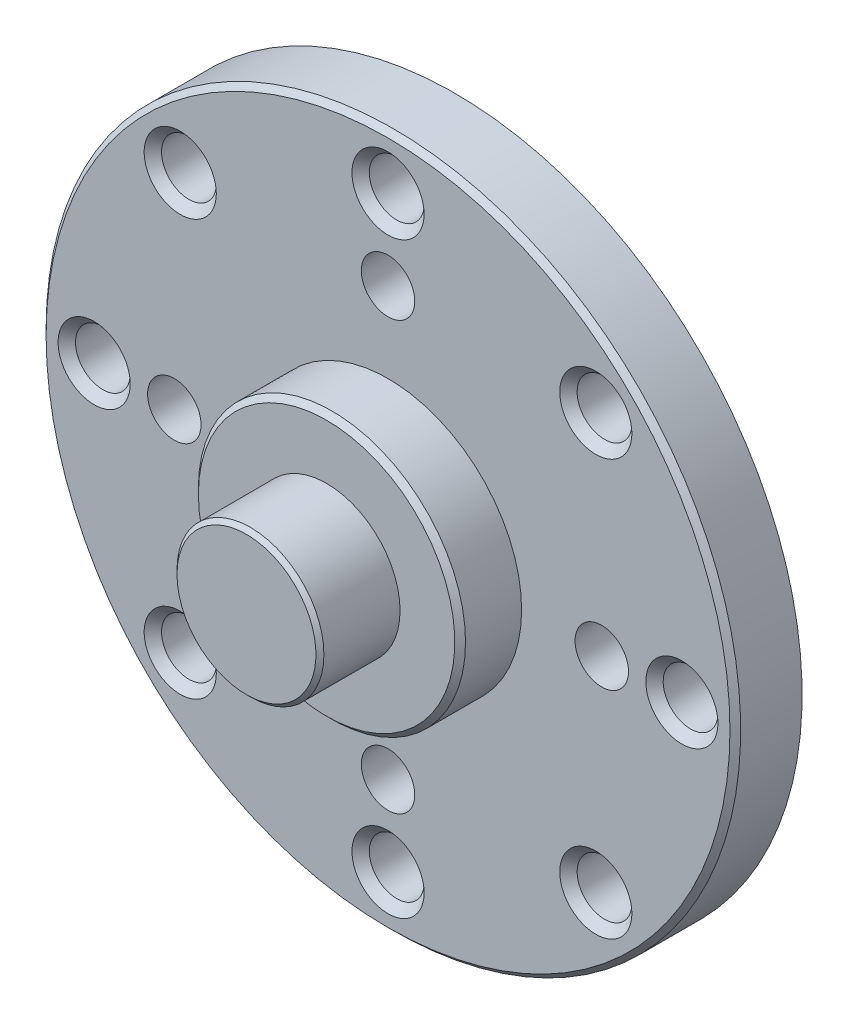
ISO-10303-21;
HEADER;
FILE_DESCRIPTION(('STEP AP214'),'2;1');
FILE_NAME('part.step','',(''),(''),'','','');
FILE_SCHEMA(('AUTOMOTIVE_DESIGN { 1 0 10303 214 1 1 1 1 }'));
ENDSEC;
DATA;
#1=APPLICATION_CONTEXT('core data for automotive mechanical design processes');
#2=APPLICATION_PROTOCOL_DEFINITION('international standard','automotive_design',2000,#1);
#3=PRODUCT_CONTEXT('',#1,'mechanical');
#4=PRODUCT('Part','Part','',(#3));
#5=PRODUCT_RELATED_PRODUCT_CATEGORY('part','',(#4));
#6=PRODUCT_DEFINITION_FORMATION('','',#4);
#7=PRODUCT_DEFINITION_CONTEXT('part definition',#1,'design');
#8=PRODUCT_DEFINITION('design','',#6,#7);
#9=PRODUCT_DEFINITION_SHAPE('','',#8);
#10=(LENGTH_UNIT() NAMED_UNIT(*) SI_UNIT(.MILLI.,.METRE.));
#11=(NAMED_UNIT(*) PLANE_ANGLE_UNIT() SI_UNIT($,.RADIAN.));
#12=(NAMED_UNIT(*) SI_UNIT($,.STERADIAN.) SOLID_ANGLE_UNIT());
#13=UNCERTAINTY_MEASURE_WITH_UNIT(LENGTH_MEASURE(1.E-05),#10,'distance_accuracy_value','');
#14=(GEOMETRIC_REPRESENTATION_CONTEXT(3) GLOBAL_UNCERTAINTY_ASSIGNED_CONTEXT((#13)) GLOBAL_UNIT_ASSIGNED_CONTEXT((#10,
#11,#12)) REPRESENTATION_CONTEXT('',''));
#15=CARTESIAN_POINT('',(0.,0.,0.));
#16=DIRECTION('',(0.,0.,1.));
#17=DIRECTION('',(1.,0.,0.));
#18=AXIS2_PLACEMENT_3D('',#15,#16,#17);
#19=CARTESIAN_POINT('',(14.58431457505,13.35,22.));
#20=DIRECTION('',(0.,0.,1.));
#21=DIRECTION('',(1.,0.,0.));
#22=AXIS2_PLACEMENT_3D('',#19,#20,#21);
#23=PLANE('',#22);
#24=CARTESIAN_POINT('',(0.,11.,22.));
#25=DIRECTION('',(0.,0.,1.));
#26=DIRECTION('',(1.,0.,0.));
#27=AXIS2_PLACEMENT_3D('',#24,#25,#26);
#28=CIRCLE('',#27,1.025);
#29=CARTESIAN_POINT('',(1.025,11.,22.));
#30=VERTEX_POINT('',#29);
#31=EDGE_CURVE('E10',#30,#30,#28,.T.);
#32=ORIENTED_EDGE('',*,*,#31,.T.);
#33=EDGE_LOOP('',(#32));
#34=FACE_BOUND('',#33,.T.);
#35=CARTESIAN_POINT('',(-7.778174593052,7.778174593052,22.));
#36=DIRECTION('',(0.,0.,1.));
#37=DIRECTION('',(1.,0.,0.));
#38=AXIS2_PLACEMENT_3D('',#35,#36,#37);
#39=CIRCLE('',#38,1.025);
#40=CARTESIAN_POINT('',(-6.753174593052,7.778174593052,22.));
#41=VERTEX_POINT('',#40);
#42=EDGE_CURVE('E37',#41,#41,#39,.T.);
#43=ORIENTED_EDGE('',*,*,#42,.T.);
#44=EDGE_LOOP('',(#43));
#45=FACE_BOUND('',#44,.T.);
#46=CARTESIAN_POINT('',(-11.,0.,22.));
#47=DIRECTION('',(0.,0.,1.));
#48=DIRECTION('',(1.,0.,0.));
#49=AXIS2_PLACEMENT_3D('',#46,#47,#48);
#50=CIRCLE('',#49,1.025);
#51=CARTESIAN_POINT('',(-9.975,0.,22.));
#52=VERTEX_POINT('',#51);
#53=EDGE_CURVE('E42',#52,#52,#50,.T.);
#54=ORIENTED_EDGE('',*,*,#53,.T.);
#55=EDGE_LOOP('',(#54));
#56=FACE_BOUND('',#55,.T.);
#57=CARTESIAN_POINT('',(-7.778174593052,-7.778174593052,22.));
#58=DIRECTION('',(0.,0.,1.));
#59=DIRECTION('',(1.,0.,0.));
#60=AXIS2_PLACEMENT_3D('',#57,#58,#59);
#61=CIRCLE('',#60,1.025);
#62=CARTESIAN_POINT('',(-6.753174593052,-7.778174593052,22.));
#63=VERTEX_POINT('',#62);
#64=EDGE_CURVE('E133',#63,#63,#61,.T.);
#65=ORIENTED_EDGE('',*,*,#64,.T.);
#66=EDGE_LOOP('',(#65));
#67=FACE_BOUND('',#66,.T.);
#68=CARTESIAN_POINT('',(0.,-11.,22.));
#69=DIRECTION('',(0.,0.,1.));
#70=DIRECTION('',(1.,0.,0.));
#71=AXIS2_PLACEMENT_3D('',#68,#69,#70);
#72=CIRCLE('',#71,1.025);
#73=CARTESIAN_POINT('',(1.025,-11.,22.));
#74=VERTEX_POINT('',#73);
#75=EDGE_CURVE('E130',#74,#74,#72,.T.);
#76=ORIENTED_EDGE('',*,*,#75,.T.);
#77=EDGE_LOOP('',(#76));
#78=FACE_BOUND('',#77,.T.);
#79=CARTESIAN_POINT('',(7.778174593052,-7.778174593052,22.));
#80=DIRECTION('',(0.,0.,1.));
#81=DIRECTION('',(1.,0.,0.));
#82=AXIS2_PLACEMENT_3D('',#79,#80,#81);
#83=CIRCLE('',#82,1.025);
#84=CARTESIAN_POINT('',(8.803174593052,-7.778174593052,22.));
#85=VERTEX_POINT('',#84);
#86=EDGE_CURVE('E127',#85,#85,#83,.T.);
#87=ORIENTED_EDGE('',*,*,#86,.T.);
#88=EDGE_LOOP('',(#87));
#89=FACE_BOUND('',#88,.T.);
#90=CARTESIAN_POINT('',(11.,0.,22.));
#91=DIRECTION('',(0.,0.,1.));
#92=DIRECTION('',(1.,0.,0.));
#93=AXIS2_PLACEMENT_3D('',#90,#91,#92);
#94=CIRCLE('',#93,1.025);
#95=CARTESIAN_POINT('',(12.025,0.,22.));
#96=VERTEX_POINT('',#95);
#97=EDGE_CURVE('E124',#96,#96,#94,.T.);
#98=ORIENTED_EDGE('',*,*,#97,.T.);
#99=EDGE_LOOP('',(#98));
#100=FACE_BOUND('',#99,.T.);
#101=CARTESIAN_POINT('',(7.778174593052,7.778174593052,22.));
#102=DIRECTION('',(0.,0.,1.));
#103=DIRECTION('',(1.,0.,0.));
#104=AXIS2_PLACEMENT_3D('',#101,#102,#103);
#105=CIRCLE('',#104,1.025);
#106=CARTESIAN_POINT('',(8.803174593052,7.778174593052,22.));
#107=VERTEX_POINT('',#106);
#108=EDGE_CURVE('E120',#107,#107,#105,.T.);
#109=ORIENTED_EDGE('',*,*,#108,.T.);
#110=EDGE_LOOP('',(#109));
#111=FACE_BOUND('',#110,.T.);
#112=CARTESIAN_POINT('',(0.,8.,22.));
#113=DIRECTION('',(0.,0.,1.));
#114=DIRECTION('',(1.,0.,0.));
#115=AXIS2_PLACEMENT_3D('',#112,#113,#114);
#116=CIRCLE('',#115,1.);
#117=CARTESIAN_POINT('',(1.,8.,22.));
#118=VERTEX_POINT('',#117);
#119=EDGE_CURVE('E118',#118,#118,#116,.T.);
#120=ORIENTED_EDGE('',*,*,#119,.T.);
#121=EDGE_LOOP('',(#120));
#122=FACE_BOUND('',#121,.T.);
#123=CARTESIAN_POINT('',(8.,0.,22.));
#124=DIRECTION('',(0.,0.,1.));
#125=DIRECTION('',(1.,0.,0.));
#126=AXIS2_PLACEMENT_3D('',#123,#124,#125);
#127=CIRCLE('',#126,1.);
#128=CARTESIAN_POINT('',(9.,0.,22.));
#129=VERTEX_POINT('',#128);
#130=EDGE_CURVE('E115',#129,#129,#127,.T.);
#131=ORIENTED_EDGE('',*,*,#130,.T.);
#132=EDGE_LOOP('',(#131));
#133=FACE_BOUND('',#132,.T.);
#134=CARTESIAN_POINT('',(-8.,0.,22.));
#135=DIRECTION('',(0.,0.,1.));
#136=DIRECTION('',(1.,0.,0.));
#137=AXIS2_PLACEMENT_3D('',#134,#135,#136);
#138=CIRCLE('',#137,1.);
#139=CARTESIAN_POINT('',(-7.,0.,22.));
#140=VERTEX_POINT('',#139);
#141=EDGE_CURVE('E112',#140,#140,#138,.T.);
#142=ORIENTED_EDGE('',*,*,#141,.T.);
#143=EDGE_LOOP('',(#142));
#144=FACE_BOUND('',#143,.T.);
#145=CARTESIAN_POINT('',(0.,-8.,22.));
#146=DIRECTION('',(0.,0.,1.));
#147=DIRECTION('',(1.,0.,0.));
#148=AXIS2_PLACEMENT_3D('',#145,#146,#147);
#149=CIRCLE('',#148,1.);
#150=CARTESIAN_POINT('',(1.,-8.,22.));
#151=VERTEX_POINT('',#150);
#152=EDGE_CURVE('E65',#151,#151,#149,.T.);
#153=ORIENTED_EDGE('',*,*,#152,.T.);
#154=EDGE_LOOP('',(#153));
#155=FACE_BOUND('',#154,.T.);
#156=CARTESIAN_POINT('',(0.,0.,22.));
#157=DIRECTION('',(0.,0.,-1.));
#158=DIRECTION('',(-1.,0.,0.));
#159=AXIS2_PLACEMENT_3D('',#156,#157,#158);
#160=CIRCLE('',#159,13.);
#161=CARTESIAN_POINT('',(-13.,0.,22.));
#162=VERTEX_POINT('',#161);
#163=EDGE_CURVE('E62',#162,#162,#160,.T.);
#164=ORIENTED_EDGE('',*,*,#163,.T.);
#165=EDGE_LOOP('',(#164));
#166=FACE_BOUND('',#165,.T.);
#167=ADVANCED_FACE('F30',(#34,#45,#56,#67,#78,#89,#100,#111,#122,#133,#144,#155,#166),#23,.F.);
#168=CARTESIAN_POINT('',(0.,0.,29.8));
#169=DIRECTION('',(0.,0.,1.));
#170=DIRECTION('',(1.,0.,0.));
#171=AXIS2_PLACEMENT_3D('',#168,#169,#170);
#172=PLANE('',#171);
#173=CARTESIAN_POINT('',(0.,0.,29.7999999999661));
#174=DIRECTION('',(0.,0.,-1.));
#175=DIRECTION('',(-1.,0.,0.));
#176=AXIS2_PLACEMENT_3D('',#173,#174,#175);
#177=CIRCLE('',#176,2.59999999997262);
#178=CARTESIAN_POINT('',(-2.59999999997262,0.,29.7999999999661));
#179=VERTEX_POINT('',#178);
#180=EDGE_CURVE('E33',#179,#179,#177,.T.);
#181=ORIENTED_EDGE('',*,*,#180,.F.);
#182=EDGE_LOOP('',(#181));
#183=FACE_BOUND('',#182,.T.);
#184=ADVANCED_FACE('F160',(#183),#172,.T.);
#185=CARTESIAN_POINT('',(0.,0.,29.6499999999469));
#186=DIRECTION('',(0.,0.,-1.));
#187=DIRECTION('',(-1.,0.,0.));
#188=AXIS2_PLACEMENT_3D('',#185,#186,#187);
#189=CONICAL_SURFACE('',#188,2.74999999999181,0.785398163397448);
#190=CARTESIAN_POINT('',(0.,0.,29.65));
#191=DIRECTION('',(0.,0.,1.));
#192=DIRECTION('',(1.,0.,0.));
#193=AXIS2_PLACEMENT_3D('',#190,#191,#192);
#194=CIRCLE('',#193,2.75);
#195=CARTESIAN_POINT('',(2.75,0.,29.65));
#196=VERTEX_POINT('',#195);
#197=EDGE_CURVE('E48',#196,#196,#194,.F.);
#198=ORIENTED_EDGE('',*,*,#197,.F.);
#199=EDGE_LOOP('',(#198));
#200=FACE_BOUND('',#199,.T.);
#201=ORIENTED_EDGE('',*,*,#180,.T.);
#202=EDGE_LOOP('',(#201));
#203=FACE_BOUND('',#202,.T.);
#204=ADVANCED_FACE('F165',(#200,#203),#189,.T.);
#205=CARTESIAN_POINT('',(0.,0.,26.8));
#206=DIRECTION('',(0.,0.,1.));
#207=DIRECTION('',(1.,0.,0.));
#208=AXIS2_PLACEMENT_3D('',#205,#206,#207);
#209=CYLINDRICAL_SURFACE('',#208,2.75);
#210=CARTESIAN_POINT('',(0.,0.,26.8));
#211=DIRECTION('',(0.,0.,1.));
#212=DIRECTION('',(1.,0.,0.));
#213=AXIS2_PLACEMENT_3D('',#210,#211,#212);
#214=CIRCLE('',#213,2.75);
#215=CARTESIAN_POINT('',(2.75,0.,26.8));
#216=VERTEX_POINT('',#215);
#217=EDGE_CURVE('E45',#216,#216,#214,.T.);
#218=ORIENTED_EDGE('',*,*,#217,.T.);
#219=EDGE_LOOP('',(#218));
#220=FACE_BOUND('',#219,.T.);
#221=ORIENTED_EDGE('',*,*,#197,.T.);
#222=EDGE_LOOP('',(#221));
#223=FACE_BOUND('',#222,.T.);
#224=ADVANCED_FACE('F347',(#220,#223),#209,.T.);
#225=CARTESIAN_POINT('',(0.,0.,26.8));
#226=DIRECTION('',(0.,0.,-1.));
#227=DIRECTION('',(-1.,0.,0.));
#228=AXIS2_PLACEMENT_3D('',#225,#226,#227);
#229=PLANE('',#228);
#230=ORIENTED_EDGE('',*,*,#217,.F.);
#231=EDGE_LOOP('',(#230));
#232=FACE_BOUND('',#231,.T.);
#233=CARTESIAN_POINT('',(0.,0.,26.7999999999802));
#234=DIRECTION('',(0.,0.,-1.));
#235=DIRECTION('',(-1.,0.,0.));
#236=AXIS2_PLACEMENT_3D('',#233,#234,#235);
#237=CIRCLE('',#236,4.80000000004566);
#238=CARTESIAN_POINT('',(-4.80000000004566,0.,26.7999999999802));
#239=VERTEX_POINT('',#238);
#240=EDGE_CURVE('E47',#239,#239,#237,.T.);
#241=ORIENTED_EDGE('',*,*,#240,.F.);
#242=EDGE_LOOP('',(#241));
#243=FACE_BOUND('',#242,.T.);
#244=ADVANCED_FACE('F236',(#232,#243),#229,.F.);
#245=CARTESIAN_POINT('',(0.,0.,26.6000000000304));
#246=DIRECTION('',(0.,0.,-1.));
#247=DIRECTION('',(-1.,0.,0.));
#248=AXIS2_PLACEMENT_3D('',#245,#246,#247);
#249=CONICAL_SURFACE('',#248,4.99999999999545,0.785398163397448);
#250=CARTESIAN_POINT('',(0.,0.,26.6));
#251=DIRECTION('',(0.,0.,-1.));
#252=DIRECTION('',(-1.,0.,0.));
#253=AXIS2_PLACEMENT_3D('',#250,#251,#252);
#254=CIRCLE('',#253,5.);
#255=CARTESIAN_POINT('',(-5.,0.,26.6));
#256=VERTEX_POINT('',#255);
#257=EDGE_CURVE('E109',#256,#256,#254,.T.);
#258=ORIENTED_EDGE('',*,*,#257,.F.);
#259=EDGE_LOOP('',(#258));
#260=FACE_BOUND('',#259,.T.);
#261=ORIENTED_EDGE('',*,*,#240,.T.);
#262=EDGE_LOOP('',(#261));
#263=FACE_BOUND('',#262,.T.);
#264=ADVANCED_FACE('F232',(#260,#263),#249,.T.);
#265=CARTESIAN_POINT('',(0.,11.,24.4999999999891));
#266=DIRECTION('',(0.,0.,1.));
#267=DIRECTION('',(1.,0.,0.));
#268=AXIS2_PLACEMENT_3D('',#265,#266,#267);
#269=CONICAL_SURFACE('',#268,1.35000000000218,0.785398163397448);
#270=CARTESIAN_POINT('',(0.,11.,24.1750000000138));
#271=DIRECTION('',(0.,0.,1.));
#272=DIRECTION('',(-1.,0.,0.));
#273=AXIS2_PLACEMENT_3D('',#270,#271,#272);
#274=CIRCLE('',#273,1.02500000002692);
#275=CARTESIAN_POINT('',(-1.02500000002692,11.,24.1750000000138));
#276=VERTEX_POINT('',#275);
#277=EDGE_CURVE('E52',#276,#276,#274,.T.);
#278=ORIENTED_EDGE('',*,*,#277,.F.);
#279=EDGE_LOOP('',(#278));
#280=FACE_BOUND('',#279,.T.);
#281=CARTESIAN_POINT('',(0.,11.,24.4999999999891));
#282=DIRECTION('',(0.,0.,1.));
#283=DIRECTION('',(1.,0.,0.));
#284=AXIS2_PLACEMENT_3D('',#281,#282,#283);
#285=CIRCLE('',#284,1.35000000000218);
#286=CARTESIAN_POINT('',(1.35000000000218,11.,24.4999999999891));
#287=VERTEX_POINT('',#286);
#288=EDGE_CURVE('E106',#287,#287,#285,.T.);
#289=ORIENTED_EDGE('',*,*,#288,.T.);
#290=EDGE_LOOP('',(#289));
#291=FACE_BOUND('',#290,.T.);
#292=ADVANCED_FACE('F229',(#280,#291),#269,.F.);
#293=CARTESIAN_POINT('',(0.,11.,21.22832375877));
#294=DIRECTION('',(0.,0.,1.));
#295=DIRECTION('',(1.,0.,0.));
#296=AXIS2_PLACEMENT_3D('',#293,#294,#295);
#297=CYLINDRICAL_SURFACE('',#296,1.025);
#298=ORIENTED_EDGE('',*,*,#277,.T.);
#299=EDGE_LOOP('',(#298));
#300=FACE_BOUND('',#299,.T.);
#301=ORIENTED_EDGE('',*,*,#31,.F.);
#302=EDGE_LOOP('',(#301));
#303=FACE_BOUND('',#302,.T.);
#304=ADVANCED_FACE('F227',(#300,#303),#297,.F.);
#305=CARTESIAN_POINT('',(-7.778174593052,7.778174593052,24.4999999999891));
#306=DIRECTION('',(0.,0.,1.));
#307=DIRECTION('',(1.,0.,0.));
#308=AXIS2_PLACEMENT_3D('',#305,#306,#307);
#309=CONICAL_SURFACE('',#308,1.34999999994634,0.785398163416473);
#310=CARTESIAN_POINT('',(-7.778174593052,7.778174593052,24.1750000000138));
#311=DIRECTION('',(0.,0.,1.));
#312=DIRECTION('',(-0.707106781190956,-0.707106781182139,0.));
#313=AXIS2_PLACEMENT_3D('',#310,#311,#312);
#314=CIRCLE('',#313,1.02499999999201);
#315=CARTESIAN_POINT('',(-8.50295904376708,7.05339014234596,24.1750000000138));
#316=VERTEX_POINT('',#315);
#317=EDGE_CURVE('E332',#316,#316,#314,.T.);
#318=ORIENTED_EDGE('',*,*,#317,.F.);
#319=EDGE_LOOP('',(#318));
#320=FACE_BOUND('',#319,.T.);
#321=CARTESIAN_POINT('',(-7.778174593052,7.778174593052,24.4999999999891));
#322=DIRECTION('',(0.,0.,1.));
#323=DIRECTION('',(1.,0.,0.));
#324=AXIS2_PLACEMENT_3D('',#321,#322,#323);
#325=CIRCLE('',#324,1.34999999994634);
#326=CARTESIAN_POINT('',(-6.42817459310567,7.778174593052,24.4999999999891));
#327=VERTEX_POINT('',#326);
#328=EDGE_CURVE('E103',#327,#327,#325,.T.);
#329=ORIENTED_EDGE('',*,*,#328,.T.);
#330=EDGE_LOOP('',(#329));
#331=FACE_BOUND('',#330,.T.);
#332=ADVANCED_FACE('F224',(#320,#331),#309,.F.);
#333=CARTESIAN_POINT('',(-7.778174593052,7.778174593052,21.22832375877));
#334=DIRECTION('',(0.,0.,1.));
#335=DIRECTION('',(1.,0.,0.));
#336=AXIS2_PLACEMENT_3D('',#333,#334,#335);
#337=CYLINDRICAL_SURFACE('',#336,1.025);
#338=ORIENTED_EDGE('',*,*,#317,.T.);
#339=EDGE_LOOP('',(#338));
#340=FACE_BOUND('',#339,.T.);
#341=ORIENTED_EDGE('',*,*,#42,.F.);
#342=EDGE_LOOP('',(#341));
#343=FACE_BOUND('',#342,.T.);
#344=ADVANCED_FACE('F153',(#340,#343),#337,.F.);
#345=CARTESIAN_POINT('',(-11.,0.,24.4999999999891));
#346=DIRECTION('',(0.,0.,1.));
#347=DIRECTION('',(1.,0.,0.));
#348=AXIS2_PLACEMENT_3D('',#345,#346,#347);
#349=CONICAL_SURFACE('',#348,1.35000000000218,0.785398163397448);
#350=CARTESIAN_POINT('',(-11.,0.,24.1750000000138));
#351=DIRECTION('',(0.,0.,1.));
#352=DIRECTION('',(0.,-1.,0.));
#353=AXIS2_PLACEMENT_3D('',#350,#351,#352);
#354=CIRCLE('',#353,1.02500000002692);
#355=CARTESIAN_POINT('',(-11.,-1.02500000002692,24.1750000000138));
#356=VERTEX_POINT('',#355);
#357=EDGE_CURVE('E331',#356,#356,#354,.T.);
#358=ORIENTED_EDGE('',*,*,#357,.F.);
#359=EDGE_LOOP('',(#358));
#360=FACE_BOUND('',#359,.T.);
#361=CARTESIAN_POINT('',(-11.,0.,24.4999999999891));
#362=DIRECTION('',(0.,0.,1.));
#363=DIRECTION('',(1.,0.,0.));
#364=AXIS2_PLACEMENT_3D('',#361,#362,#363);
#365=CIRCLE('',#364,1.35000000000218);
#366=CARTESIAN_POINT('',(-9.64999999999782,0.,24.4999999999891));
#367=VERTEX_POINT('',#366);
#368=EDGE_CURVE('E100',#367,#367,#365,.T.);
#369=ORIENTED_EDGE('',*,*,#368,.T.);
#370=EDGE_LOOP('',(#369));
#371=FACE_BOUND('',#370,.T.);
#372=ADVANCED_FACE('F143',(#360,#371),#349,.F.);
#373=CARTESIAN_POINT('',(-11.,0.,21.22832375877));
#374=DIRECTION('',(0.,0.,1.));
#375=DIRECTION('',(1.,0.,0.));
#376=AXIS2_PLACEMENT_3D('',#373,#374,#375);
#377=CYLINDRICAL_SURFACE('',#376,1.025);
#378=ORIENTED_EDGE('',*,*,#357,.T.);
#379=EDGE_LOOP('',(#378));
#380=FACE_BOUND('',#379,.T.);
#381=ORIENTED_EDGE('',*,*,#53,.F.);
#382=EDGE_LOOP('',(#381));
#383=FACE_BOUND('',#382,.T.);
#384=ADVANCED_FACE('F140',(#380,#383),#377,.F.);
#385=CARTESIAN_POINT('',(-7.778174593052,-7.778174593052,24.4999999999891));
#386=DIRECTION('',(0.,0.,1.));
#387=DIRECTION('',(1.,0.,0.));
#388=AXIS2_PLACEMENT_3D('',#385,#386,#387);
#389=CONICAL_SURFACE('',#388,1.34999999994634,0.785398163416473);
#390=CARTESIAN_POINT('',(-7.778174593052,-7.778174593052,24.1750000000138));
#391=DIRECTION('',(0.,0.,1.));
#392=DIRECTION('',(0.707106781182139,-0.707106781190956,0.));
#393=AXIS2_PLACEMENT_3D('',#390,#391,#392);
#394=CIRCLE('',#393,1.02499999999201);
#395=CARTESIAN_POINT('',(-7.05339014234596,-8.50295904376708,24.1750000000138));
#396=VERTEX_POINT('',#395);
#397=EDGE_CURVE('E256',#396,#396,#394,.T.);
#398=ORIENTED_EDGE('',*,*,#397,.F.);
#399=EDGE_LOOP('',(#398));
#400=FACE_BOUND('',#399,.T.);
#401=CARTESIAN_POINT('',(-7.778174593052,-7.778174593052,24.4999999999891));
#402=DIRECTION('',(0.,0.,1.));
#403=DIRECTION('',(1.,0.,0.));
#404=AXIS2_PLACEMENT_3D('',#401,#402,#403);
#405=CIRCLE('',#404,1.34999999994634);
#406=CARTESIAN_POINT('',(-6.42817459310567,-7.778174593052,24.4999999999891));
#407=VERTEX_POINT('',#406);
#408=EDGE_CURVE('E97',#407,#407,#405,.T.);
#409=ORIENTED_EDGE('',*,*,#408,.T.);
#410=EDGE_LOOP('',(#409));
#411=FACE_BOUND('',#410,.T.);
#412=ADVANCED_FACE('F142',(#400,#411),#389,.F.);
#413=CARTESIAN_POINT('',(-7.778174593052,-7.778174593052,21.22832375877));
#414=DIRECTION('',(0.,0.,1.));
#415=DIRECTION('',(1.,0.,0.));
#416=AXIS2_PLACEMENT_3D('',#413,#414,#415);
#417=CYLINDRICAL_SURFACE('',#416,1.025);
#418=ORIENTED_EDGE('',*,*,#397,.T.);
#419=EDGE_LOOP('',(#418));
#420=FACE_BOUND('',#419,.T.);
#421=ORIENTED_EDGE('',*,*,#64,.F.);
#422=EDGE_LOOP('',(#421));
#423=FACE_BOUND('',#422,.T.);
#424=ADVANCED_FACE('F150',(#420,#423),#417,.F.);
#425=CARTESIAN_POINT('',(0.,-11.,24.4999999999891));
#426=DIRECTION('',(0.,0.,1.));
#427=DIRECTION('',(1.,0.,0.));
#428=AXIS2_PLACEMENT_3D('',#425,#426,#427);
#429=CONICAL_SURFACE('',#428,1.35000000000218,0.785398163397448);
#430=CARTESIAN_POINT('',(0.,-11.,24.1750000000138));
#431=DIRECTION('',(0.,0.,1.));
#432=DIRECTION('',(1.,0.,0.));
#433=AXIS2_PLACEMENT_3D('',#430,#431,#432);
#434=CIRCLE('',#433,1.02500000002692);
#435=CARTESIAN_POINT('',(1.02500000002692,-11.,24.1750000000138));
#436=VERTEX_POINT('',#435);
#437=EDGE_CURVE('E327',#436,#436,#434,.T.);
#438=ORIENTED_EDGE('',*,*,#437,.F.);
#439=EDGE_LOOP('',(#438));
#440=FACE_BOUND('',#439,.T.);
#441=CARTESIAN_POINT('',(0.,-11.,24.4999999999891));
#442=DIRECTION('',(0.,0.,1.));
#443=DIRECTION('',(1.,0.,0.));
#444=AXIS2_PLACEMENT_3D('',#441,#442,#443);
#445=CIRCLE('',#444,1.35000000000218);
#446=CARTESIAN_POINT('',(1.35000000000218,-11.,24.4999999999891));
#447=VERTEX_POINT('',#446);
#448=EDGE_CURVE('E94',#447,#447,#445,.T.);
#449=ORIENTED_EDGE('',*,*,#448,.T.);
#450=EDGE_LOOP('',(#449));
#451=FACE_BOUND('',#450,.T.);
#452=ADVANCED_FACE('F220',(#440,#451),#429,.F.);
#453=CARTESIAN_POINT('',(0.,-11.,21.22832375877));
#454=DIRECTION('',(0.,0.,1.));
#455=DIRECTION('',(1.,0.,0.));
#456=AXIS2_PLACEMENT_3D('',#453,#454,#455);
#457=CYLINDRICAL_SURFACE('',#456,1.025);
#458=ORIENTED_EDGE('',*,*,#437,.T.);
#459=EDGE_LOOP('',(#458));
#460=FACE_BOUND('',#459,.T.);
#461=ORIENTED_EDGE('',*,*,#75,.F.);
#462=EDGE_LOOP('',(#461));
#463=FACE_BOUND('',#462,.T.);
#464=ADVANCED_FACE('F218',(#460,#463),#457,.F.);
#465=CARTESIAN_POINT('',(7.778174593052,-7.778174593052,24.4999999999891));
#466=DIRECTION('',(0.,0.,1.));
#467=DIRECTION('',(1.,0.,0.));
#468=AXIS2_PLACEMENT_3D('',#465,#466,#467);
#469=CONICAL_SURFACE('',#468,1.34999999994634,0.785398163416473);
#470=CARTESIAN_POINT('',(7.778174593052,-7.778174593052,24.1750000000138));
#471=DIRECTION('',(0.,0.,1.));
#472=DIRECTION('',(0.707106781190956,0.707106781182139,0.));
#473=AXIS2_PLACEMENT_3D('',#470,#471,#472);
#474=CIRCLE('',#473,1.02499999999201);
#475=CARTESIAN_POINT('',(8.50295904376708,-7.05339014234596,24.1750000000138));
#476=VERTEX_POINT('',#475);
#477=EDGE_CURVE('E324',#476,#476,#474,.T.);
#478=ORIENTED_EDGE('',*,*,#477,.F.);
#479=EDGE_LOOP('',(#478));
#480=FACE_BOUND('',#479,.T.);
#481=CARTESIAN_POINT('',(7.778174593052,-7.778174593052,24.4999999999891));
#482=DIRECTION('',(0.,0.,1.));
#483=DIRECTION('',(1.,0.,0.));
#484=AXIS2_PLACEMENT_3D('',#481,#482,#483);
#485=CIRCLE('',#484,1.34999999994634);
#486=CARTESIAN_POINT('',(9.12817459299834,-7.778174593052,24.4999999999891));
#487=VERTEX_POINT('',#486);
#488=EDGE_CURVE('E91',#487,#487,#485,.T.);
#489=ORIENTED_EDGE('',*,*,#488,.T.);
#490=EDGE_LOOP('',(#489));
#491=FACE_BOUND('',#490,.T.);
#492=ADVANCED_FACE('F215',(#480,#491),#469,.F.);
#493=CARTESIAN_POINT('',(7.778174593052,-7.778174593052,21.22832375877));
#494=DIRECTION('',(0.,0.,1.));
#495=DIRECTION('',(1.,0.,0.));
#496=AXIS2_PLACEMENT_3D('',#493,#494,#495);
#497=CYLINDRICAL_SURFACE('',#496,1.025);
#498=ORIENTED_EDGE('',*,*,#477,.T.);
#499=EDGE_LOOP('',(#498));
#500=FACE_BOUND('',#499,.T.);
#501=ORIENTED_EDGE('',*,*,#86,.F.);
#502=EDGE_LOOP('',(#501));
#503=FACE_BOUND('',#502,.T.);
#504=ADVANCED_FACE('F213',(#500,#503),#497,.F.);
#505=CARTESIAN_POINT('',(11.,0.,24.4999999999891));
#506=DIRECTION('',(0.,0.,1.));
#507=DIRECTION('',(1.,0.,0.));
#508=AXIS2_PLACEMENT_3D('',#505,#506,#507);
#509=CONICAL_SURFACE('',#508,1.35000000000218,0.785398163397448);
#510=CARTESIAN_POINT('',(11.,0.,24.1750000000138));
#511=DIRECTION('',(0.,0.,1.));
#512=DIRECTION('',(0.,1.,0.));
#513=AXIS2_PLACEMENT_3D('',#510,#511,#512);
#514=CIRCLE('',#513,1.02500000002692);
#515=CARTESIAN_POINT('',(11.,1.02500000002692,24.1750000000138));
#516=VERTEX_POINT('',#515);
#517=EDGE_CURVE('E318',#516,#516,#514,.T.);
#518=ORIENTED_EDGE('',*,*,#517,.F.);
#519=EDGE_LOOP('',(#518));
#520=FACE_BOUND('',#519,.T.);
#521=CARTESIAN_POINT('',(11.,0.,24.4999999999891));
#522=DIRECTION('',(0.,0.,1.));
#523=DIRECTION('',(1.,0.,0.));
#524=AXIS2_PLACEMENT_3D('',#521,#522,#523);
#525=CIRCLE('',#524,1.35000000000218);
#526=CARTESIAN_POINT('',(12.3500000000022,0.,24.4999999999891));
#527=VERTEX_POINT('',#526);
#528=EDGE_CURVE('E88',#527,#527,#525,.T.);
#529=ORIENTED_EDGE('',*,*,#528,.T.);
#530=EDGE_LOOP('',(#529));
#531=FACE_BOUND('',#530,.T.);
#532=ADVANCED_FACE('F210',(#520,#531),#509,.F.);
#533=CARTESIAN_POINT('',(11.,0.,21.22832375877));
#534=DIRECTION('',(0.,0.,1.));
#535=DIRECTION('',(1.,0.,0.));
#536=AXIS2_PLACEMENT_3D('',#533,#534,#535);
#537=CYLINDRICAL_SURFACE('',#536,1.025);
#538=ORIENTED_EDGE('',*,*,#517,.T.);
#539=EDGE_LOOP('',(#538));
#540=FACE_BOUND('',#539,.T.);
#541=ORIENTED_EDGE('',*,*,#97,.F.);
#542=EDGE_LOOP('',(#541));
#543=FACE_BOUND('',#542,.T.);
#544=ADVANCED_FACE('F208',(#540,#543),#537,.F.);
#545=CARTESIAN_POINT('',(7.778174593052,7.778174593052,24.4999999999891));
#546=DIRECTION('',(0.,0.,1.));
#547=DIRECTION('',(1.,0.,0.));
#548=AXIS2_PLACEMENT_3D('',#545,#546,#547);
#549=CONICAL_SURFACE('',#548,1.34999999994634,0.785398163416473);
#550=CARTESIAN_POINT('',(7.778174593052,7.778174593052,24.1750000000138));
#551=DIRECTION('',(0.,0.,1.));
#552=DIRECTION('',(-0.707106781182139,0.707106781190956,0.));
#553=AXIS2_PLACEMENT_3D('',#550,#551,#552);
#554=CIRCLE('',#553,1.02499999999201);
#555=CARTESIAN_POINT('',(7.05339014234596,8.50295904376708,24.1750000000138));
#556=VERTEX_POINT('',#555);
#557=EDGE_CURVE('E315',#556,#556,#554,.T.);
#558=ORIENTED_EDGE('',*,*,#557,.F.);
#559=EDGE_LOOP('',(#558));
#560=FACE_BOUND('',#559,.T.);
#561=CARTESIAN_POINT('',(7.778174593052,7.778174593052,24.4999999999891));
#562=DIRECTION('',(0.,0.,1.));
#563=DIRECTION('',(1.,0.,0.));
#564=AXIS2_PLACEMENT_3D('',#561,#562,#563);
#565=CIRCLE('',#564,1.34999999994634);
#566=CARTESIAN_POINT('',(9.12817459299834,7.778174593052,24.4999999999891));
#567=VERTEX_POINT('',#566);
#568=EDGE_CURVE('E85',#567,#567,#565,.T.);
#569=ORIENTED_EDGE('',*,*,#568,.T.);
#570=EDGE_LOOP('',(#569));
#571=FACE_BOUND('',#570,.T.);
#572=ADVANCED_FACE('F205',(#560,#571),#549,.F.);
#573=CARTESIAN_POINT('',(7.778174593052,7.778174593052,21.22832375877));
#574=DIRECTION('',(0.,0.,1.));
#575=DIRECTION('',(1.,0.,0.));
#576=AXIS2_PLACEMENT_3D('',#573,#574,#575);
#577=CYLINDRICAL_SURFACE('',#576,1.025);
#578=ORIENTED_EDGE('',*,*,#557,.T.);
#579=EDGE_LOOP('',(#578));
#580=FACE_BOUND('',#579,.T.);
#581=ORIENTED_EDGE('',*,*,#108,.F.);
#582=EDGE_LOOP('',(#581));
#583=FACE_BOUND('',#582,.T.);
#584=ADVANCED_FACE('F203',(#580,#583),#577,.F.);
#585=CARTESIAN_POINT('',(0.,0.,27.25));
#586=DIRECTION('',(0.,0.,-1.));
#587=DIRECTION('',(-1.,0.,0.));
#588=AXIS2_PLACEMENT_3D('',#585,#586,#587);
#589=CYLINDRICAL_SURFACE('',#588,5.);
#590=CARTESIAN_POINT('',(0.,0.,24.5));
#591=DIRECTION('',(0.,0.,-1.));
#592=DIRECTION('',(-1.,0.,0.));
#593=AXIS2_PLACEMENT_3D('',#590,#591,#592);
#594=CIRCLE('',#593,5.);
#595=CARTESIAN_POINT('',(-5.,0.,24.5));
#596=VERTEX_POINT('',#595);
#597=EDGE_CURVE('E82',#596,#596,#594,.F.);
#598=ORIENTED_EDGE('',*,*,#597,.T.);
#599=EDGE_LOOP('',(#598));
#600=FACE_BOUND('',#599,.T.);
#601=ORIENTED_EDGE('',*,*,#257,.T.);
#602=EDGE_LOOP('',(#601));
#603=FACE_BOUND('',#602,.T.);
#604=ADVANCED_FACE('F185',(#600,#603),#589,.T.);
#605=CARTESIAN_POINT('',(0.,0.,24.5));
#606=DIRECTION('',(0.,0.,-1.));
#607=DIRECTION('',(-1.,0.,0.));
#608=AXIS2_PLACEMENT_3D('',#605,#606,#607);
#609=PLANE('',#608);
#610=CARTESIAN_POINT('',(0.,-8.,24.5));
#611=DIRECTION('',(0.,0.,1.));
#612=DIRECTION('',(1.,0.,0.));
#613=AXIS2_PLACEMENT_3D('',#610,#611,#612);
#614=CIRCLE('',#613,1.);
#615=CARTESIAN_POINT('',(1.,-8.,24.5));
#616=VERTEX_POINT('',#615);
#617=EDGE_CURVE('E70',#616,#616,#614,.T.);
#618=ORIENTED_EDGE('',*,*,#617,.F.);
#619=EDGE_LOOP('',(#618));
#620=FACE_BOUND('',#619,.T.);
#621=CARTESIAN_POINT('',(-8.,0.,24.5));
#622=DIRECTION('',(0.,0.,1.));
#623=DIRECTION('',(1.,0.,0.));
#624=AXIS2_PLACEMENT_3D('',#621,#622,#623);
#625=CIRCLE('',#624,1.);
#626=CARTESIAN_POINT('',(-7.,0.,24.5));
#627=VERTEX_POINT('',#626);
#628=EDGE_CURVE('E73',#627,#627,#625,.T.);
#629=ORIENTED_EDGE('',*,*,#628,.F.);
#630=EDGE_LOOP('',(#629));
#631=FACE_BOUND('',#630,.T.);
#632=CARTESIAN_POINT('',(8.,0.,24.5));
#633=DIRECTION('',(0.,0.,1.));
#634=DIRECTION('',(1.,0.,0.));
#635=AXIS2_PLACEMENT_3D('',#632,#633,#634);
#636=CIRCLE('',#635,1.);
#637=CARTESIAN_POINT('',(9.,0.,24.5));
#638=VERTEX_POINT('',#637);
#639=EDGE_CURVE('E76',#638,#638,#636,.T.);
#640=ORIENTED_EDGE('',*,*,#639,.F.);
#641=EDGE_LOOP('',(#640));
#642=FACE_BOUND('',#641,.T.);
#643=CARTESIAN_POINT('',(0.,8.,24.5));
#644=DIRECTION('',(0.,0.,1.));
#645=DIRECTION('',(1.,0.,0.));
#646=AXIS2_PLACEMENT_3D('',#643,#644,#645);
#647=CIRCLE('',#646,1.);
#648=CARTESIAN_POINT('',(1.,8.,24.5));
#649=VERTEX_POINT('',#648);
#650=EDGE_CURVE('E79',#649,#649,#647,.T.);
#651=ORIENTED_EDGE('',*,*,#650,.F.);
#652=EDGE_LOOP('',(#651));
#653=FACE_BOUND('',#652,.T.);
#654=ORIENTED_EDGE('',*,*,#597,.F.);
#655=EDGE_LOOP('',(#654));
#656=FACE_BOUND('',#655,.T.);
#657=ORIENTED_EDGE('',*,*,#568,.F.);
#658=EDGE_LOOP('',(#657));
#659=FACE_BOUND('',#658,.T.);
#660=ORIENTED_EDGE('',*,*,#528,.F.);
#661=EDGE_LOOP('',(#660));
#662=FACE_BOUND('',#661,.T.);
#663=ORIENTED_EDGE('',*,*,#488,.F.);
#664=EDGE_LOOP('',(#663));
#665=FACE_BOUND('',#664,.T.);
#666=ORIENTED_EDGE('',*,*,#448,.F.);
#667=EDGE_LOOP('',(#666));
#668=FACE_BOUND('',#667,.T.);
#669=ORIENTED_EDGE('',*,*,#408,.F.);
#670=EDGE_LOOP('',(#669));
#671=FACE_BOUND('',#670,.T.);
#672=ORIENTED_EDGE('',*,*,#368,.F.);
#673=EDGE_LOOP('',(#672));
#674=FACE_BOUND('',#673,.T.);
#675=ORIENTED_EDGE('',*,*,#328,.F.);
#676=EDGE_LOOP('',(#675));
#677=FACE_BOUND('',#676,.T.);
#678=ORIENTED_EDGE('',*,*,#288,.F.);
#679=EDGE_LOOP('',(#678));
#680=FACE_BOUND('',#679,.T.);
#681=CARTESIAN_POINT('',(0.,0.,24.5));
#682=DIRECTION('',(0.,0.,-1.));
#683=DIRECTION('',(-1.,0.,0.));
#684=AXIS2_PLACEMENT_3D('',#681,#682,#683);
#685=CIRCLE('',#684,12.8);
#686=CARTESIAN_POINT('',(-12.8,0.,24.5));
#687=VERTEX_POINT('',#686);
#688=EDGE_CURVE('E67',#687,#687,#685,.T.);
#689=ORIENTED_EDGE('',*,*,#688,.F.);
#690=EDGE_LOOP('',(#689));
#691=FACE_BOUND('',#690,.T.);
#692=ADVANCED_FACE('F181',(#620,#631,#642,#653,#656,#659,#662,#665,#668,#671,#674,#677,#680,
#691),#609,.F.);
#693=CARTESIAN_POINT('',(0.,-8.,24.5));
#694=DIRECTION('',(0.,0.,1.));
#695=DIRECTION('',(1.,0.,0.));
#696=AXIS2_PLACEMENT_3D('',#693,#694,#695);
#697=CYLINDRICAL_SURFACE('',#696,1.);
#698=ORIENTED_EDGE('',*,*,#152,.F.);
#699=EDGE_LOOP('',(#698));
#700=FACE_BOUND('',#699,.T.);
#701=ORIENTED_EDGE('',*,*,#617,.T.);
#702=EDGE_LOOP('',(#701));
#703=FACE_BOUND('',#702,.T.);
#704=ADVANCED_FACE('F184',(#700,#703),#697,.F.);
#705=CARTESIAN_POINT('',(-8.,0.,24.5));
#706=DIRECTION('',(0.,0.,1.));
#707=DIRECTION('',(1.,0.,0.));
#708=AXIS2_PLACEMENT_3D('',#705,#706,#707);
#709=CYLINDRICAL_SURFACE('',#708,1.);
#710=ORIENTED_EDGE('',*,*,#141,.F.);
#711=EDGE_LOOP('',(#710));
#712=FACE_BOUND('',#711,.T.);
#713=ORIENTED_EDGE('',*,*,#628,.T.);
#714=EDGE_LOOP('',(#713));
#715=FACE_BOUND('',#714,.T.);
#716=ADVANCED_FACE('F189',(#712,#715),#709,.F.);
#717=CARTESIAN_POINT('',(8.,0.,24.5));
#718=DIRECTION('',(0.,0.,1.));
#719=DIRECTION('',(1.,0.,0.));
#720=AXIS2_PLACEMENT_3D('',#717,#718,#719);
#721=CYLINDRICAL_SURFACE('',#720,1.);
#722=ORIENTED_EDGE('',*,*,#130,.F.);
#723=EDGE_LOOP('',(#722));
#724=FACE_BOUND('',#723,.T.);
#725=ORIENTED_EDGE('',*,*,#639,.T.);
#726=EDGE_LOOP('',(#725));
#727=FACE_BOUND('',#726,.T.);
#728=ADVANCED_FACE('F193',(#724,#727),#721,.F.);
#729=CARTESIAN_POINT('',(0.,8.,24.5));
#730=DIRECTION('',(0.,0.,1.));
#731=DIRECTION('',(1.,0.,0.));
#732=AXIS2_PLACEMENT_3D('',#729,#730,#731);
#733=CYLINDRICAL_SURFACE('',#732,1.);
#734=ORIENTED_EDGE('',*,*,#119,.F.);
#735=EDGE_LOOP('',(#734));
#736=FACE_BOUND('',#735,.T.);
#737=ORIENTED_EDGE('',*,*,#650,.T.);
#738=EDGE_LOOP('',(#737));
#739=FACE_BOUND('',#738,.T.);
#740=ADVANCED_FACE('F175',(#736,#739),#733,.F.);
#741=CARTESIAN_POINT('',(0.,0.,24.3));
#742=DIRECTION('',(0.,0.,-1.));
#743=DIRECTION('',(-1.,0.,0.));
#744=AXIS2_PLACEMENT_3D('',#741,#742,#743);
#745=CONICAL_SURFACE('',#744,13.,0.785398163397301);
#746=CARTESIAN_POINT('',(0.,0.,24.3));
#747=DIRECTION('',(0.,0.,-1.));
#748=DIRECTION('',(-1.,0.,0.));
#749=AXIS2_PLACEMENT_3D('',#746,#747,#748);
#750=CIRCLE('',#749,13.);
#751=CARTESIAN_POINT('',(-13.,0.,24.3));
#752=VERTEX_POINT('',#751);
#753=EDGE_CURVE('E66',#752,#752,#750,.T.);
#754=ORIENTED_EDGE('',*,*,#753,.F.);
#755=EDGE_LOOP('',(#754));
#756=FACE_BOUND('',#755,.T.);
#757=ORIENTED_EDGE('',*,*,#688,.T.);
#758=EDGE_LOOP('',(#757));
#759=FACE_BOUND('',#758,.T.);
#760=ADVANCED_FACE('F169',(#756,#759),#745,.T.);
#761=CARTESIAN_POINT('',(0.,0.,27.25));
#762=DIRECTION('',(0.,0.,-1.));
#763=DIRECTION('',(-1.,0.,0.));
#764=AXIS2_PLACEMENT_3D('',#761,#762,#763);
#765=CYLINDRICAL_SURFACE('',#764,13.);
#766=ORIENTED_EDGE('',*,*,#163,.F.);
#767=EDGE_LOOP('',(#766));
#768=FACE_BOUND('',#767,.T.);
#769=ORIENTED_EDGE('',*,*,#753,.T.);
#770=EDGE_LOOP('',(#769));
#771=FACE_BOUND('',#770,.T.);
#772=ADVANCED_FACE('F161',(#768,#771),#765,.T.);
#773=CLOSED_SHELL('',(#167,#184,#204,#224,#244,#264,#292,#304,#332,#344,#372,#384,#412,#424,
#452,#464,#492,#504,#532,#544,#572,#584,#604,#692,#704,#716,#728,#740,#760,#772));
#774=MANIFOLD_SOLID_BREP('B2',#773);
#775=ADVANCED_BREP_SHAPE_REPRESENTATION('',(#18,#774),#14);
#776=SHAPE_DEFINITION_REPRESENTATION(#9,#775);
ENDSEC;
END-ISO-10303-21;
